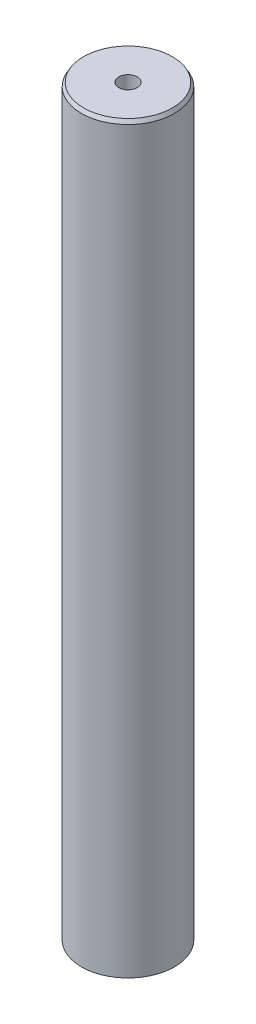
ISO-10303-21;
HEADER;
FILE_DESCRIPTION(('STEP AP214'),'2;1');
FILE_NAME('part.step','',(''),(''),'','','');
FILE_SCHEMA(('AUTOMOTIVE_DESIGN { 1 0 10303 214 1 1 1 1 }'));
ENDSEC;
DATA;
#1=APPLICATION_CONTEXT('core data for automotive mechanical design processes');
#2=APPLICATION_PROTOCOL_DEFINITION('international standard','automotive_design',2000,#1);
#3=PRODUCT_CONTEXT('',#1,'mechanical');
#4=PRODUCT('Part','Part','',(#3));
#5=PRODUCT_RELATED_PRODUCT_CATEGORY('part','',(#4));
#6=PRODUCT_DEFINITION_FORMATION('','',#4);
#7=PRODUCT_DEFINITION_CONTEXT('part definition',#1,'design');
#8=PRODUCT_DEFINITION('design','',#6,#7);
#9=PRODUCT_DEFINITION_SHAPE('','',#8);
#10=(LENGTH_UNIT() NAMED_UNIT(*) SI_UNIT(.MILLI.,.METRE.));
#11=(NAMED_UNIT(*) PLANE_ANGLE_UNIT() SI_UNIT($,.RADIAN.));
#12=(NAMED_UNIT(*) SI_UNIT($,.STERADIAN.) SOLID_ANGLE_UNIT());
#13=UNCERTAINTY_MEASURE_WITH_UNIT(LENGTH_MEASURE(1.E-05),#10,'distance_accuracy_value','');
#14=(GEOMETRIC_REPRESENTATION_CONTEXT(3) GLOBAL_UNCERTAINTY_ASSIGNED_CONTEXT((#13)) GLOBAL_UNIT_ASSIGNED_CONTEXT((#10,
#11,#12)) REPRESENTATION_CONTEXT('',''));
#15=CARTESIAN_POINT('',(0.,0.,0.));
#16=DIRECTION('',(0.,0.,1.));
#17=DIRECTION('',(1.,0.,0.));
#18=AXIS2_PLACEMENT_3D('',#15,#16,#17);
#19=CARTESIAN_POINT('',(0.,400.,0.));
#20=DIRECTION('',(0.,-1.,0.));
#21=DIRECTION('',(0.,0.,-1.));
#22=AXIS2_PLACEMENT_3D('',#19,#20,#21);
#23=CYLINDRICAL_SURFACE('',#22,25.);
#24=CARTESIAN_POINT('',(0.,398.,0.));
#25=DIRECTION('',(0.,1.,0.));
#26=DIRECTION('',(0.,0.,1.));
#27=AXIS2_PLACEMENT_3D('',#24,#25,#26);
#28=CIRCLE('',#27,25.);
#29=CARTESIAN_POINT('',(0.,398.,25.));
#30=VERTEX_POINT('',#29);
#31=EDGE_CURVE('E50',#30,#30,#28,.F.);
#32=ORIENTED_EDGE('',*,*,#31,.T.);
#33=EDGE_LOOP('',(#32));
#34=FACE_BOUND('',#33,.T.);
#35=CARTESIAN_POINT('',(0.,1.15470053837924,0.));
#36=DIRECTION('',(0.,1.,0.));
#37=DIRECTION('',(0.,0.,1.));
#38=AXIS2_PLACEMENT_3D('',#35,#36,#37);
#39=CIRCLE('',#38,25.);
#40=CARTESIAN_POINT('',(0.,1.15470053837924,25.));
#41=VERTEX_POINT('',#40);
#42=EDGE_CURVE('E51',#41,#41,#39,.T.);
#43=ORIENTED_EDGE('',*,*,#42,.T.);
#44=EDGE_LOOP('',(#43));
#45=FACE_BOUND('',#44,.T.);
#46=ADVANCED_FACE('F39',(#34,#45),#23,.T.);
#47=CARTESIAN_POINT('',(0.,400.,0.));
#48=DIRECTION('',(0.,1.,0.));
#49=DIRECTION('',(0.,0.,1.));
#50=AXIS2_PLACEMENT_3D('',#47,#48,#49);
#51=PLANE('',#50);
#52=CARTESIAN_POINT('',(0.,400.,0.));
#53=DIRECTION('',(0.,1.,0.));
#54=DIRECTION('',(0.,0.,1.));
#55=AXIS2_PLACEMENT_3D('',#52,#53,#54);
#56=CIRCLE('',#55,23.8452994616208);
#57=CARTESIAN_POINT('',(0.,400.,23.8452994616208));
#58=VERTEX_POINT('',#57);
#59=EDGE_CURVE('E54',#58,#58,#56,.T.);
#60=ORIENTED_EDGE('',*,*,#59,.T.);
#61=EDGE_LOOP('',(#60));
#62=FACE_BOUND('',#61,.T.);
#63=CARTESIAN_POINT('',(0.,400.,0.));
#64=DIRECTION('',(0.,1.,0.));
#65=DIRECTION('',(0.,0.,1.));
#66=AXIS2_PLACEMENT_3D('',#63,#64,#65);
#67=CIRCLE('',#66,5.);
#68=CARTESIAN_POINT('',(0.,400.,5.));
#69=VERTEX_POINT('',#68);
#70=EDGE_CURVE('E58',#69,#69,#67,.T.);
#71=ORIENTED_EDGE('',*,*,#70,.F.);
#72=EDGE_LOOP('',(#71));
#73=FACE_BOUND('',#72,.T.);
#74=ADVANCED_FACE('F69',(#62,#73),#51,.T.);
#75=CARTESIAN_POINT('',(0.,0.,0.));
#76=DIRECTION('',(0.,1.,0.));
#77=DIRECTION('',(0.,0.,1.));
#78=AXIS2_PLACEMENT_3D('',#75,#76,#77);
#79=PLANE('',#78);
#80=CARTESIAN_POINT('',(0.,0.,0.));
#81=DIRECTION('',(0.,1.,0.));
#82=DIRECTION('',(0.,0.,1.));
#83=AXIS2_PLACEMENT_3D('',#80,#81,#82);
#84=CIRCLE('',#83,23.);
#85=CARTESIAN_POINT('',(0.,0.,23.));
#86=VERTEX_POINT('',#85);
#87=EDGE_CURVE('E10',#86,#86,#84,.F.);
#88=ORIENTED_EDGE('',*,*,#87,.T.);
#89=EDGE_LOOP('',(#88));
#90=FACE_BOUND('',#89,.T.);
#91=CARTESIAN_POINT('',(0.,0.,0.));
#92=DIRECTION('',(0.,1.,0.));
#93=DIRECTION('',(0.,0.,1.));
#94=AXIS2_PLACEMENT_3D('',#91,#92,#93);
#95=CIRCLE('',#94,5.);
#96=CARTESIAN_POINT('',(0.,0.,5.));
#97=VERTEX_POINT('',#96);
#98=EDGE_CURVE('E63',#97,#97,#95,.T.);
#99=ORIENTED_EDGE('',*,*,#98,.T.);
#100=EDGE_LOOP('',(#99));
#101=FACE_BOUND('',#100,.T.);
#102=ADVANCED_FACE('F75',(#90,#101),#79,.F.);
#103=CARTESIAN_POINT('',(0.,400.,0.));
#104=DIRECTION('',(0.,-1.,0.));
#105=DIRECTION('',(0.,0.,-1.));
#106=AXIS2_PLACEMENT_3D('',#103,#104,#105);
#107=CYLINDRICAL_SURFACE('',#106,5.);
#108=ORIENTED_EDGE('',*,*,#70,.T.);
#109=EDGE_LOOP('',(#108));
#110=FACE_BOUND('',#109,.T.);
#111=ORIENTED_EDGE('',*,*,#98,.F.);
#112=EDGE_LOOP('',(#111));
#113=FACE_BOUND('',#112,.T.);
#114=ADVANCED_FACE('F70',(#110,#113),#107,.F.);
#115=CARTESIAN_POINT('',(0.,400.,0.));
#116=DIRECTION('',(0.,-1.,0.));
#117=DIRECTION('',(0.,0.,-1.));
#118=AXIS2_PLACEMENT_3D('',#115,#116,#117);
#119=CONICAL_SURFACE('',#118,23.8452994616208,0.523598775598286);
#120=ORIENTED_EDGE('',*,*,#31,.F.);
#121=EDGE_LOOP('',(#120));
#122=FACE_BOUND('',#121,.T.);
#123=ORIENTED_EDGE('',*,*,#59,.F.);
#124=EDGE_LOOP('',(#123));
#125=FACE_BOUND('',#124,.T.);
#126=ADVANCED_FACE('F81',(#122,#125),#119,.T.);
#127=CARTESIAN_POINT('',(0.,1.15470053837924,0.));
#128=DIRECTION('',(0.,1.,0.));
#129=DIRECTION('',(0.,0.,1.));
#130=AXIS2_PLACEMENT_3D('',#127,#128,#129);
#131=CONICAL_SURFACE('',#130,25.,1.0471975511966);
#132=ORIENTED_EDGE('',*,*,#87,.F.);
#133=EDGE_LOOP('',(#132));
#134=FACE_BOUND('',#133,.T.);
#135=ORIENTED_EDGE('',*,*,#42,.F.);
#136=EDGE_LOOP('',(#135));
#137=FACE_BOUND('',#136,.T.);
#138=ADVANCED_FACE('F45',(#134,#137),#131,.T.);
#139=CLOSED_SHELL('',(#46,#74,#102,#114,#126,#138));
#140=MANIFOLD_SOLID_BREP('B2',#139);
#141=ADVANCED_BREP_SHAPE_REPRESENTATION('',(#18,#140),#14);
#142=SHAPE_DEFINITION_REPRESENTATION(#9,#141);
ENDSEC;
END-ISO-10303-21;
